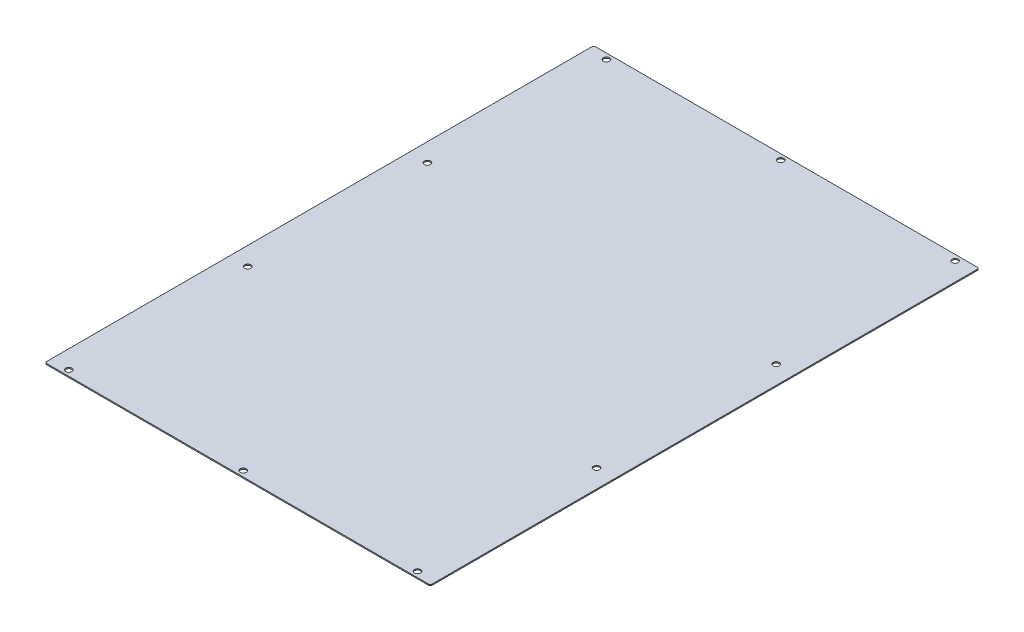
ISO-10303-21;
HEADER;
FILE_DESCRIPTION(('STEP AP214'),'2;1');
FILE_NAME('part.step','',(''),(''),'','','');
FILE_SCHEMA(('AUTOMOTIVE_DESIGN { 1 0 10303 214 1 1 1 1 }'));
ENDSEC;
DATA;
#1=APPLICATION_CONTEXT('core data for automotive mechanical design processes');
#2=APPLICATION_PROTOCOL_DEFINITION('international standard','automotive_design',2000,#1);
#3=PRODUCT_CONTEXT('',#1,'mechanical');
#4=PRODUCT('Part','Part','',(#3));
#5=PRODUCT_RELATED_PRODUCT_CATEGORY('part','',(#4));
#6=PRODUCT_DEFINITION_FORMATION('','',#4);
#7=PRODUCT_DEFINITION_CONTEXT('part definition',#1,'design');
#8=PRODUCT_DEFINITION('design','',#6,#7);
#9=PRODUCT_DEFINITION_SHAPE('','',#8);
#10=(LENGTH_UNIT() NAMED_UNIT(*) SI_UNIT(.MILLI.,.METRE.));
#11=(NAMED_UNIT(*) PLANE_ANGLE_UNIT() SI_UNIT($,.RADIAN.));
#12=(NAMED_UNIT(*) SI_UNIT($,.STERADIAN.) SOLID_ANGLE_UNIT());
#13=UNCERTAINTY_MEASURE_WITH_UNIT(LENGTH_MEASURE(1.E-05),#10,'distance_accuracy_value','');
#14=(GEOMETRIC_REPRESENTATION_CONTEXT(3) GLOBAL_UNCERTAINTY_ASSIGNED_CONTEXT((#13)) GLOBAL_UNIT_ASSIGNED_CONTEXT((#10,
#11,#12)) REPRESENTATION_CONTEXT('',''));
#15=CARTESIAN_POINT('',(0.,0.,0.));
#16=DIRECTION('',(0.,0.,1.));
#17=DIRECTION('',(1.,0.,0.));
#18=AXIS2_PLACEMENT_3D('',#15,#16,#17);
#19=CARTESIAN_POINT('',(0.,0.,0.));
#20=DIRECTION('',(0.,1.,0.));
#21=DIRECTION('',(0.,0.,1.));
#22=AXIS2_PLACEMENT_3D('',#19,#20,#21);
#23=PLANE('',#22);
#24=DIRECTION('',(0.,0.,-1.));
#25=VECTOR('',#24,1.);
#26=CARTESIAN_POINT('',(173.25,0.,-246.65));
#27=LINE('',#26,#25);
#28=CARTESIAN_POINT('',(173.25,0.,-245.65));
#29=VERTEX_POINT('',#28);
#30=CARTESIAN_POINT('',(173.25,0.,245.65));
#31=VERTEX_POINT('',#30);
#32=EDGE_CURVE('E424',#29,#31,#27,.F.);
#33=ORIENTED_EDGE('',*,*,#32,.F.);
#34=DIRECTION('',(0.707106781186567,0.,0.707106781186528));
#35=VECTOR('',#34,1.);
#36=CARTESIAN_POINT('',(173.25,0.,-245.65));
#37=LINE('',#36,#35);
#38=CARTESIAN_POINT('',(172.25,0.,-246.65));
#39=VERTEX_POINT('',#38);
#40=EDGE_CURVE('E427',#29,#39,#37,.F.);
#41=ORIENTED_EDGE('',*,*,#40,.T.);
#42=DIRECTION('',(-1.,0.,0.));
#43=VECTOR('',#42,1.);
#44=CARTESIAN_POINT('',(-173.25,0.,-246.65));
#45=LINE('',#44,#43);
#46=CARTESIAN_POINT('',(-172.25,0.,-246.65));
#47=VERTEX_POINT('',#46);
#48=EDGE_CURVE('E437',#47,#39,#45,.F.);
#49=ORIENTED_EDGE('',*,*,#48,.F.);
#50=DIRECTION('',(0.707106781186548,0.,-0.707106781186548));
#51=VECTOR('',#50,1.);
#52=CARTESIAN_POINT('',(-172.25,0.,-246.65));
#53=LINE('',#52,#51);
#54=CARTESIAN_POINT('',(-173.25,0.,-245.65));
#55=VERTEX_POINT('',#54);
#56=EDGE_CURVE('E452',#47,#55,#53,.F.);
#57=ORIENTED_EDGE('',*,*,#56,.T.);
#58=DIRECTION('',(0.,0.,1.));
#59=VECTOR('',#58,1.);
#60=CARTESIAN_POINT('',(-173.25,0.,-246.65));
#61=LINE('',#60,#59);
#62=CARTESIAN_POINT('',(-173.25,0.,245.65));
#63=VERTEX_POINT('',#62);
#64=EDGE_CURVE('E94',#63,#55,#61,.F.);
#65=ORIENTED_EDGE('',*,*,#64,.F.);
#66=DIRECTION('',(-0.707106781186567,0.,-0.707106781186528));
#67=VECTOR('',#66,1.);
#68=CARTESIAN_POINT('',(-173.25,0.,245.65));
#69=LINE('',#68,#67);
#70=CARTESIAN_POINT('',(-172.25,0.,246.65));
#71=VERTEX_POINT('',#70);
#72=EDGE_CURVE('E89',#63,#71,#69,.F.);
#73=ORIENTED_EDGE('',*,*,#72,.T.);
#74=DIRECTION('',(1.,0.,0.));
#75=VECTOR('',#74,1.);
#76=CARTESIAN_POINT('',(-173.25,0.,246.65));
#77=LINE('',#76,#75);
#78=CARTESIAN_POINT('',(172.25,0.,246.65));
#79=VERTEX_POINT('',#78);
#80=EDGE_CURVE('E79',#79,#71,#77,.F.);
#81=ORIENTED_EDGE('',*,*,#80,.F.);
#82=DIRECTION('',(-0.707106781186548,0.,0.707106781186548));
#83=VECTOR('',#82,1.);
#84=CARTESIAN_POINT('',(172.25,0.,246.65));
#85=LINE('',#84,#83);
#86=EDGE_CURVE('E104',#79,#31,#85,.F.);
#87=ORIENTED_EDGE('',*,*,#86,.T.);
#88=EDGE_LOOP('',(#33,#41,#49,#57,#65,#73,#81,#87));
#89=FACE_BOUND('',#88,.T.);
#90=CARTESIAN_POINT('',(-156.75,0.,-241.65));
#91=DIRECTION('',(0.,1.,0.));
#92=DIRECTION('',(0.,0.,1.));
#93=AXIS2_PLACEMENT_3D('',#90,#91,#92);
#94=CIRCLE('',#93,2.75);
#95=CARTESIAN_POINT('',(-156.75,0.,-238.9));
#96=VERTEX_POINT('',#95);
#97=EDGE_CURVE('E98',#96,#96,#94,.F.);
#98=ORIENTED_EDGE('',*,*,#97,.T.);
#99=EDGE_LOOP('',(#98));
#100=FACE_BOUND('',#99,.T.);
#101=CARTESIAN_POINT('',(-156.75,0.,241.65));
#102=DIRECTION('',(0.,1.,0.));
#103=DIRECTION('',(0.,0.,1.));
#104=AXIS2_PLACEMENT_3D('',#101,#102,#103);
#105=CIRCLE('',#104,2.75);
#106=CARTESIAN_POINT('',(-156.75,0.,244.4));
#107=VERTEX_POINT('',#106);
#108=EDGE_CURVE('E141',#107,#107,#105,.F.);
#109=ORIENTED_EDGE('',*,*,#108,.T.);
#110=EDGE_LOOP('',(#109));
#111=FACE_BOUND('',#110,.T.);
#112=CARTESIAN_POINT('',(156.75,0.,-80.75));
#113=DIRECTION('',(0.,1.,0.));
#114=DIRECTION('',(0.,0.,1.));
#115=AXIS2_PLACEMENT_3D('',#112,#113,#114);
#116=CIRCLE('',#115,2.75);
#117=CARTESIAN_POINT('',(156.75,0.,-78.));
#118=VERTEX_POINT('',#117);
#119=EDGE_CURVE('E144',#118,#118,#116,.F.);
#120=ORIENTED_EDGE('',*,*,#119,.T.);
#121=EDGE_LOOP('',(#120));
#122=FACE_BOUND('',#121,.T.);
#123=CARTESIAN_POINT('',(-156.75,0.,-80.75));
#124=DIRECTION('',(0.,1.,0.));
#125=DIRECTION('',(0.,0.,1.));
#126=AXIS2_PLACEMENT_3D('',#123,#124,#125);
#127=CIRCLE('',#126,2.75);
#128=CARTESIAN_POINT('',(-156.75,0.,-78.));
#129=VERTEX_POINT('',#128);
#130=EDGE_CURVE('E147',#129,#129,#127,.F.);
#131=ORIENTED_EDGE('',*,*,#130,.T.);
#132=EDGE_LOOP('',(#131));
#133=FACE_BOUND('',#132,.T.);
#134=CARTESIAN_POINT('',(156.75,0.,-241.65));
#135=DIRECTION('',(0.,1.,0.));
#136=DIRECTION('',(0.,0.,1.));
#137=AXIS2_PLACEMENT_3D('',#134,#135,#136);
#138=CIRCLE('',#137,2.75);
#139=CARTESIAN_POINT('',(156.75,0.,-238.9));
#140=VERTEX_POINT('',#139);
#141=EDGE_CURVE('E150',#140,#140,#138,.F.);
#142=ORIENTED_EDGE('',*,*,#141,.T.);
#143=EDGE_LOOP('',(#142));
#144=FACE_BOUND('',#143,.T.);
#145=CARTESIAN_POINT('',(-156.75,0.,80.75));
#146=DIRECTION('',(0.,1.,0.));
#147=DIRECTION('',(0.,0.,1.));
#148=AXIS2_PLACEMENT_3D('',#145,#146,#147);
#149=CIRCLE('',#148,2.75);
#150=CARTESIAN_POINT('',(-156.75,0.,83.5));
#151=VERTEX_POINT('',#150);
#152=EDGE_CURVE('E153',#151,#151,#149,.F.);
#153=ORIENTED_EDGE('',*,*,#152,.T.);
#154=EDGE_LOOP('',(#153));
#155=FACE_BOUND('',#154,.T.);
#156=CARTESIAN_POINT('',(156.75,0.,80.75));
#157=DIRECTION('',(0.,1.,0.));
#158=DIRECTION('',(0.,0.,1.));
#159=AXIS2_PLACEMENT_3D('',#156,#157,#158);
#160=CIRCLE('',#159,2.75);
#161=CARTESIAN_POINT('',(156.75,0.,83.5));
#162=VERTEX_POINT('',#161);
#163=EDGE_CURVE('E156',#162,#162,#160,.F.);
#164=ORIENTED_EDGE('',*,*,#163,.T.);
#165=EDGE_LOOP('',(#164));
#166=FACE_BOUND('',#165,.T.);
#167=CARTESIAN_POINT('',(0.,0.,241.65));
#168=DIRECTION('',(0.,1.,0.));
#169=DIRECTION('',(0.,0.,1.));
#170=AXIS2_PLACEMENT_3D('',#167,#168,#169);
#171=CIRCLE('',#170,2.75);
#172=CARTESIAN_POINT('',(0.,0.,244.4));
#173=VERTEX_POINT('',#172);
#174=EDGE_CURVE('E159',#173,#173,#171,.F.);
#175=ORIENTED_EDGE('',*,*,#174,.T.);
#176=EDGE_LOOP('',(#175));
#177=FACE_BOUND('',#176,.T.);
#178=CARTESIAN_POINT('',(0.,0.,-241.65));
#179=DIRECTION('',(0.,1.,0.));
#180=DIRECTION('',(0.,0.,1.));
#181=AXIS2_PLACEMENT_3D('',#178,#179,#180);
#182=CIRCLE('',#181,2.75);
#183=CARTESIAN_POINT('',(0.,0.,-238.9));
#184=VERTEX_POINT('',#183);
#185=EDGE_CURVE('E161',#184,#184,#182,.F.);
#186=ORIENTED_EDGE('',*,*,#185,.T.);
#187=EDGE_LOOP('',(#186));
#188=FACE_BOUND('',#187,.T.);
#189=CARTESIAN_POINT('',(156.75,0.,241.65));
#190=DIRECTION('',(0.,1.,0.));
#191=DIRECTION('',(0.,0.,1.));
#192=AXIS2_PLACEMENT_3D('',#189,#190,#191);
#193=CIRCLE('',#192,2.75);
#194=CARTESIAN_POINT('',(156.75,0.,244.4));
#195=VERTEX_POINT('',#194);
#196=EDGE_CURVE('E20',#195,#195,#193,.F.);
#197=ORIENTED_EDGE('',*,*,#196,.T.);
#198=EDGE_LOOP('',(#197));
#199=FACE_BOUND('',#198,.T.);
#200=ADVANCED_FACE('F17',(#89,#100,#111,#122,#133,#144,#155,#166,#177,#188,#199),#23,.T.);
#201=CARTESIAN_POINT('',(156.75,-1.,241.65));
#202=DIRECTION('',(0.,1.,0.));
#203=DIRECTION('',(0.,0.,1.));
#204=AXIS2_PLACEMENT_3D('',#201,#202,#203);
#205=CYLINDRICAL_SURFACE('',#204,2.75);
#206=CARTESIAN_POINT('',(156.75,-1.,241.65));
#207=DIRECTION('',(0.,1.,0.));
#208=DIRECTION('',(0.,0.,1.));
#209=AXIS2_PLACEMENT_3D('',#206,#207,#208);
#210=CIRCLE('',#209,2.75);
#211=CARTESIAN_POINT('',(156.75,-1.,244.4));
#212=VERTEX_POINT('',#211);
#213=EDGE_CURVE('E135',#212,#212,#210,.F.);
#214=ORIENTED_EDGE('',*,*,#213,.T.);
#215=EDGE_LOOP('',(#214));
#216=FACE_BOUND('',#215,.T.);
#217=ORIENTED_EDGE('',*,*,#196,.F.);
#218=EDGE_LOOP('',(#217));
#219=FACE_BOUND('',#218,.T.);
#220=ADVANCED_FACE('F169',(#216,#219),#205,.F.);
#221=CARTESIAN_POINT('',(0.,-1.,-241.65));
#222=DIRECTION('',(0.,1.,0.));
#223=DIRECTION('',(0.,0.,1.));
#224=AXIS2_PLACEMENT_3D('',#221,#222,#223);
#225=CYLINDRICAL_SURFACE('',#224,2.75);
#226=CARTESIAN_POINT('',(0.,-1.,-241.65));
#227=DIRECTION('',(0.,1.,0.));
#228=DIRECTION('',(0.,0.,1.));
#229=AXIS2_PLACEMENT_3D('',#226,#227,#228);
#230=CIRCLE('',#229,2.75);
#231=CARTESIAN_POINT('',(0.,-1.,-238.9));
#232=VERTEX_POINT('',#231);
#233=EDGE_CURVE('E132',#232,#232,#230,.F.);
#234=ORIENTED_EDGE('',*,*,#233,.T.);
#235=EDGE_LOOP('',(#234));
#236=FACE_BOUND('',#235,.T.);
#237=ORIENTED_EDGE('',*,*,#185,.F.);
#238=EDGE_LOOP('',(#237));
#239=FACE_BOUND('',#238,.T.);
#240=ADVANCED_FACE('F171',(#236,#239),#225,.F.);
#241=CARTESIAN_POINT('',(0.,-1.,241.65));
#242=DIRECTION('',(0.,1.,0.));
#243=DIRECTION('',(0.,0.,1.));
#244=AXIS2_PLACEMENT_3D('',#241,#242,#243);
#245=CYLINDRICAL_SURFACE('',#244,2.75);
#246=CARTESIAN_POINT('',(0.,-1.,241.65));
#247=DIRECTION('',(0.,1.,0.));
#248=DIRECTION('',(0.,0.,1.));
#249=AXIS2_PLACEMENT_3D('',#246,#247,#248);
#250=CIRCLE('',#249,2.75);
#251=CARTESIAN_POINT('',(0.,-1.,244.4));
#252=VERTEX_POINT('',#251);
#253=EDGE_CURVE('E129',#252,#252,#250,.F.);
#254=ORIENTED_EDGE('',*,*,#253,.T.);
#255=EDGE_LOOP('',(#254));
#256=FACE_BOUND('',#255,.T.);
#257=ORIENTED_EDGE('',*,*,#174,.F.);
#258=EDGE_LOOP('',(#257));
#259=FACE_BOUND('',#258,.T.);
#260=ADVANCED_FACE('F178',(#256,#259),#245,.F.);
#261=CARTESIAN_POINT('',(156.75,-1.,80.75));
#262=DIRECTION('',(0.,1.,0.));
#263=DIRECTION('',(0.,0.,1.));
#264=AXIS2_PLACEMENT_3D('',#261,#262,#263);
#265=CYLINDRICAL_SURFACE('',#264,2.75);
#266=CARTESIAN_POINT('',(156.75,-1.,80.75));
#267=DIRECTION('',(0.,1.,0.));
#268=DIRECTION('',(0.,0.,1.));
#269=AXIS2_PLACEMENT_3D('',#266,#267,#268);
#270=CIRCLE('',#269,2.75);
#271=CARTESIAN_POINT('',(156.75,-1.,83.5));
#272=VERTEX_POINT('',#271);
#273=EDGE_CURVE('E126',#272,#272,#270,.F.);
#274=ORIENTED_EDGE('',*,*,#273,.T.);
#275=EDGE_LOOP('',(#274));
#276=FACE_BOUND('',#275,.T.);
#277=ORIENTED_EDGE('',*,*,#163,.F.);
#278=EDGE_LOOP('',(#277));
#279=FACE_BOUND('',#278,.T.);
#280=ADVANCED_FACE('F240',(#276,#279),#265,.F.);
#281=CARTESIAN_POINT('',(-156.75,-1.,80.75));
#282=DIRECTION('',(0.,1.,0.));
#283=DIRECTION('',(0.,0.,1.));
#284=AXIS2_PLACEMENT_3D('',#281,#282,#283);
#285=CYLINDRICAL_SURFACE('',#284,2.75);
#286=CARTESIAN_POINT('',(-156.75,-1.,80.75));
#287=DIRECTION('',(0.,1.,0.));
#288=DIRECTION('',(0.,0.,1.));
#289=AXIS2_PLACEMENT_3D('',#286,#287,#288);
#290=CIRCLE('',#289,2.75);
#291=CARTESIAN_POINT('',(-156.75,-1.,83.5));
#292=VERTEX_POINT('',#291);
#293=EDGE_CURVE('E123',#292,#292,#290,.F.);
#294=ORIENTED_EDGE('',*,*,#293,.T.);
#295=EDGE_LOOP('',(#294));
#296=FACE_BOUND('',#295,.T.);
#297=ORIENTED_EDGE('',*,*,#152,.F.);
#298=EDGE_LOOP('',(#297));
#299=FACE_BOUND('',#298,.T.);
#300=ADVANCED_FACE('F236',(#296,#299),#285,.F.);
#301=CARTESIAN_POINT('',(156.75,-1.,-241.65));
#302=DIRECTION('',(0.,1.,0.));
#303=DIRECTION('',(0.,0.,1.));
#304=AXIS2_PLACEMENT_3D('',#301,#302,#303);
#305=CYLINDRICAL_SURFACE('',#304,2.75);
#306=CARTESIAN_POINT('',(156.75,-1.,-241.65));
#307=DIRECTION('',(0.,1.,0.));
#308=DIRECTION('',(0.,0.,1.));
#309=AXIS2_PLACEMENT_3D('',#306,#307,#308);
#310=CIRCLE('',#309,2.75);
#311=CARTESIAN_POINT('',(156.75,-1.,-238.9));
#312=VERTEX_POINT('',#311);
#313=EDGE_CURVE('E120',#312,#312,#310,.F.);
#314=ORIENTED_EDGE('',*,*,#313,.T.);
#315=EDGE_LOOP('',(#314));
#316=FACE_BOUND('',#315,.T.);
#317=ORIENTED_EDGE('',*,*,#141,.F.);
#318=EDGE_LOOP('',(#317));
#319=FACE_BOUND('',#318,.T.);
#320=ADVANCED_FACE('F232',(#316,#319),#305,.F.);
#321=CARTESIAN_POINT('',(-156.75,-1.,-80.75));
#322=DIRECTION('',(0.,1.,0.));
#323=DIRECTION('',(0.,0.,1.));
#324=AXIS2_PLACEMENT_3D('',#321,#322,#323);
#325=CYLINDRICAL_SURFACE('',#324,2.75);
#326=CARTESIAN_POINT('',(-156.75,-1.,-80.75));
#327=DIRECTION('',(0.,1.,0.));
#328=DIRECTION('',(0.,0.,1.));
#329=AXIS2_PLACEMENT_3D('',#326,#327,#328);
#330=CIRCLE('',#329,2.75);
#331=CARTESIAN_POINT('',(-156.75,-1.,-78.));
#332=VERTEX_POINT('',#331);
#333=EDGE_CURVE('E117',#332,#332,#330,.F.);
#334=ORIENTED_EDGE('',*,*,#333,.T.);
#335=EDGE_LOOP('',(#334));
#336=FACE_BOUND('',#335,.T.);
#337=ORIENTED_EDGE('',*,*,#130,.F.);
#338=EDGE_LOOP('',(#337));
#339=FACE_BOUND('',#338,.T.);
#340=ADVANCED_FACE('F228',(#336,#339),#325,.F.);
#341=CARTESIAN_POINT('',(156.75,-1.,-80.75));
#342=DIRECTION('',(0.,1.,0.));
#343=DIRECTION('',(0.,0.,1.));
#344=AXIS2_PLACEMENT_3D('',#341,#342,#343);
#345=CYLINDRICAL_SURFACE('',#344,2.75);
#346=CARTESIAN_POINT('',(156.75,-1.,-80.75));
#347=DIRECTION('',(0.,1.,0.));
#348=DIRECTION('',(0.,0.,1.));
#349=AXIS2_PLACEMENT_3D('',#346,#347,#348);
#350=CIRCLE('',#349,2.75);
#351=CARTESIAN_POINT('',(156.75,-1.,-78.));
#352=VERTEX_POINT('',#351);
#353=EDGE_CURVE('E114',#352,#352,#350,.F.);
#354=ORIENTED_EDGE('',*,*,#353,.T.);
#355=EDGE_LOOP('',(#354));
#356=FACE_BOUND('',#355,.T.);
#357=ORIENTED_EDGE('',*,*,#119,.F.);
#358=EDGE_LOOP('',(#357));
#359=FACE_BOUND('',#358,.T.);
#360=ADVANCED_FACE('F224',(#356,#359),#345,.F.);
#361=CARTESIAN_POINT('',(-156.75,-1.,241.65));
#362=DIRECTION('',(0.,1.,0.));
#363=DIRECTION('',(0.,0.,1.));
#364=AXIS2_PLACEMENT_3D('',#361,#362,#363);
#365=CYLINDRICAL_SURFACE('',#364,2.75);
#366=CARTESIAN_POINT('',(-156.75,-1.,241.65));
#367=DIRECTION('',(0.,1.,0.));
#368=DIRECTION('',(0.,0.,1.));
#369=AXIS2_PLACEMENT_3D('',#366,#367,#368);
#370=CIRCLE('',#369,2.75);
#371=CARTESIAN_POINT('',(-156.75,-1.,244.4));
#372=VERTEX_POINT('',#371);
#373=EDGE_CURVE('E111',#372,#372,#370,.F.);
#374=ORIENTED_EDGE('',*,*,#373,.T.);
#375=EDGE_LOOP('',(#374));
#376=FACE_BOUND('',#375,.T.);
#377=ORIENTED_EDGE('',*,*,#108,.F.);
#378=EDGE_LOOP('',(#377));
#379=FACE_BOUND('',#378,.T.);
#380=ADVANCED_FACE('F220',(#376,#379),#365,.F.);
#381=CARTESIAN_POINT('',(-156.75,-1.,-241.65));
#382=DIRECTION('',(0.,1.,0.));
#383=DIRECTION('',(0.,0.,1.));
#384=AXIS2_PLACEMENT_3D('',#381,#382,#383);
#385=CYLINDRICAL_SURFACE('',#384,2.75);
#386=CARTESIAN_POINT('',(-156.75,-1.,-241.65));
#387=DIRECTION('',(0.,1.,0.));
#388=DIRECTION('',(0.,0.,1.));
#389=AXIS2_PLACEMENT_3D('',#386,#387,#388);
#390=CIRCLE('',#389,2.75);
#391=CARTESIAN_POINT('',(-156.75,-1.,-238.9));
#392=VERTEX_POINT('',#391);
#393=EDGE_CURVE('E108',#392,#392,#390,.F.);
#394=ORIENTED_EDGE('',*,*,#393,.T.);
#395=EDGE_LOOP('',(#394));
#396=FACE_BOUND('',#395,.T.);
#397=ORIENTED_EDGE('',*,*,#97,.F.);
#398=EDGE_LOOP('',(#397));
#399=FACE_BOUND('',#398,.T.);
#400=ADVANCED_FACE('F217',(#396,#399),#385,.F.);
#401=CARTESIAN_POINT('',(-173.25,-1.,245.65));
#402=DIRECTION('',(0.707106781186528,0.,-0.707106781186567));
#403=DIRECTION('',(-0.707106781186567,0.,-0.707106781186528));
#404=AXIS2_PLACEMENT_3D('',#401,#402,#403);
#405=PLANE('',#404);
#406=DIRECTION('',(0.,1.,0.));
#407=VECTOR('',#406,1.);
#408=CARTESIAN_POINT('',(-172.25,-1.,246.65));
#409=LINE('',#408,#407);
#410=CARTESIAN_POINT('',(-172.25,-1.,246.65));
#411=VERTEX_POINT('',#410);
#412=EDGE_CURVE('E86',#71,#411,#409,.F.);
#413=ORIENTED_EDGE('',*,*,#412,.F.);
#414=ORIENTED_EDGE('',*,*,#72,.F.);
#415=DIRECTION('',(0.,1.,0.));
#416=VECTOR('',#415,1.);
#417=CARTESIAN_POINT('',(-173.25,-1.,245.65));
#418=LINE('',#417,#416);
#419=CARTESIAN_POINT('',(-173.25,-1.,245.65));
#420=VERTEX_POINT('',#419);
#421=EDGE_CURVE('E138',#420,#63,#418,.T.);
#422=ORIENTED_EDGE('',*,*,#421,.F.);
#423=DIRECTION('',(0.707106781186567,0.,0.707106781186528));
#424=VECTOR('',#423,1.);
#425=CARTESIAN_POINT('',(-173.25,-1.,245.65));
#426=LINE('',#425,#424);
#427=EDGE_CURVE('E102',#420,#411,#426,.T.);
#428=ORIENTED_EDGE('',*,*,#427,.T.);
#429=EDGE_LOOP('',(#413,#414,#422,#428));
#430=FACE_BOUND('',#429,.T.);
#431=ADVANCED_FACE('F101',(#430),#405,.F.);
#432=CARTESIAN_POINT('',(-173.25,-1.,246.65));
#433=DIRECTION('',(0.,0.,1.));
#434=DIRECTION('',(1.,0.,0.));
#435=AXIS2_PLACEMENT_3D('',#432,#433,#434);
#436=PLANE('',#435);
#437=ORIENTED_EDGE('',*,*,#80,.T.);
#438=ORIENTED_EDGE('',*,*,#412,.T.);
#439=DIRECTION('',(1.,0.,0.));
#440=VECTOR('',#439,1.);
#441=CARTESIAN_POINT('',(0.,-1.,246.65));
#442=LINE('',#441,#440);
#443=CARTESIAN_POINT('',(172.25,-1.,246.65));
#444=VERTEX_POINT('',#443);
#445=EDGE_CURVE('E443',#411,#444,#442,.T.);
#446=ORIENTED_EDGE('',*,*,#445,.T.);
#447=DIRECTION('',(0.,1.,0.));
#448=VECTOR('',#447,1.);
#449=CARTESIAN_POINT('',(172.25,-1.,246.65));
#450=LINE('',#449,#448);
#451=EDGE_CURVE('E88',#444,#79,#450,.T.);
#452=ORIENTED_EDGE('',*,*,#451,.T.);
#453=EDGE_LOOP('',(#437,#438,#446,#452));
#454=FACE_BOUND('',#453,.T.);
#455=ADVANCED_FACE('F83',(#454),#436,.T.);
#456=CARTESIAN_POINT('',(172.25,-1.,246.65));
#457=DIRECTION('',(-0.707106781186548,0.,-0.707106781186548));
#458=DIRECTION('',(-0.707106781186548,0.,0.707106781186548));
#459=AXIS2_PLACEMENT_3D('',#456,#457,#458);
#460=PLANE('',#459);
#461=DIRECTION('',(0.,1.,0.));
#462=VECTOR('',#461,1.);
#463=CARTESIAN_POINT('',(173.25,-1.,245.65));
#464=LINE('',#463,#462);
#465=CARTESIAN_POINT('',(173.25,-1.,245.65));
#466=VERTEX_POINT('',#465);
#467=EDGE_CURVE('E418',#31,#466,#464,.F.);
#468=ORIENTED_EDGE('',*,*,#467,.F.);
#469=ORIENTED_EDGE('',*,*,#86,.F.);
#470=ORIENTED_EDGE('',*,*,#451,.F.);
#471=DIRECTION('',(0.707106781186557,0.,-0.707106781186538));
#472=VECTOR('',#471,1.);
#473=CARTESIAN_POINT('',(172.25,-1.,246.65));
#474=LINE('',#473,#472);
#475=EDGE_CURVE('E420',#444,#466,#474,.T.);
#476=ORIENTED_EDGE('',*,*,#475,.T.);
#477=EDGE_LOOP('',(#468,#469,#470,#476));
#478=FACE_BOUND('',#477,.T.);
#479=ADVANCED_FACE('F208',(#478),#460,.F.);
#480=CARTESIAN_POINT('',(173.25,-1.,-246.65));
#481=DIRECTION('',(1.,0.,0.));
#482=DIRECTION('',(0.,0.,-1.));
#483=AXIS2_PLACEMENT_3D('',#480,#481,#482);
#484=PLANE('',#483);
#485=ORIENTED_EDGE('',*,*,#32,.T.);
#486=ORIENTED_EDGE('',*,*,#467,.T.);
#487=DIRECTION('',(0.,0.,1.));
#488=VECTOR('',#487,1.);
#489=CARTESIAN_POINT('',(173.25,-1.,0.));
#490=LINE('',#489,#488);
#491=CARTESIAN_POINT('',(173.25,-1.,-245.65));
#492=VERTEX_POINT('',#491);
#493=EDGE_CURVE('E438',#466,#492,#490,.F.);
#494=ORIENTED_EDGE('',*,*,#493,.T.);
#495=DIRECTION('',(0.,1.,0.));
#496=VECTOR('',#495,1.);
#497=CARTESIAN_POINT('',(173.25,-1.,-245.65));
#498=LINE('',#497,#496);
#499=EDGE_CURVE('E423',#492,#29,#498,.T.);
#500=ORIENTED_EDGE('',*,*,#499,.T.);
#501=EDGE_LOOP('',(#485,#486,#494,#500));
#502=FACE_BOUND('',#501,.T.);
#503=ADVANCED_FACE('F204',(#502),#484,.T.);
#504=CARTESIAN_POINT('',(173.25,-1.,-245.65));
#505=DIRECTION('',(-0.707106781186528,0.,0.707106781186567));
#506=DIRECTION('',(0.707106781186567,0.,0.707106781186528));
#507=AXIS2_PLACEMENT_3D('',#504,#505,#506);
#508=PLANE('',#507);
#509=DIRECTION('',(0.,1.,0.));
#510=VECTOR('',#509,1.);
#511=CARTESIAN_POINT('',(172.25,-1.,-246.65));
#512=LINE('',#511,#510);
#513=CARTESIAN_POINT('',(172.25,-1.,-246.65));
#514=VERTEX_POINT('',#513);
#515=EDGE_CURVE('E436',#39,#514,#512,.F.);
#516=ORIENTED_EDGE('',*,*,#515,.F.);
#517=ORIENTED_EDGE('',*,*,#40,.F.);
#518=ORIENTED_EDGE('',*,*,#499,.F.);
#519=DIRECTION('',(-0.707106781186567,0.,-0.707106781186528));
#520=VECTOR('',#519,1.);
#521=CARTESIAN_POINT('',(173.25,-1.,-245.65));
#522=LINE('',#521,#520);
#523=EDGE_CURVE('E439',#492,#514,#522,.T.);
#524=ORIENTED_EDGE('',*,*,#523,.T.);
#525=EDGE_LOOP('',(#516,#517,#518,#524));
#526=FACE_BOUND('',#525,.T.);
#527=ADVANCED_FACE('F200',(#526),#508,.F.);
#528=CARTESIAN_POINT('',(-173.25,-1.,-246.65));
#529=DIRECTION('',(0.,0.,-1.));
#530=DIRECTION('',(-1.,0.,0.));
#531=AXIS2_PLACEMENT_3D('',#528,#529,#530);
#532=PLANE('',#531);
#533=ORIENTED_EDGE('',*,*,#48,.T.);
#534=ORIENTED_EDGE('',*,*,#515,.T.);
#535=DIRECTION('',(1.,0.,0.));
#536=VECTOR('',#535,1.);
#537=CARTESIAN_POINT('',(0.,-1.,-246.65));
#538=LINE('',#537,#536);
#539=CARTESIAN_POINT('',(-172.25,-1.,-246.65));
#540=VERTEX_POINT('',#539);
#541=EDGE_CURVE('E441',#514,#540,#538,.F.);
#542=ORIENTED_EDGE('',*,*,#541,.T.);
#543=DIRECTION('',(0.,1.,0.));
#544=VECTOR('',#543,1.);
#545=CARTESIAN_POINT('',(-172.25,-1.,-246.65));
#546=LINE('',#545,#544);
#547=EDGE_CURVE('E454',#540,#47,#546,.T.);
#548=ORIENTED_EDGE('',*,*,#547,.T.);
#549=EDGE_LOOP('',(#533,#534,#542,#548));
#550=FACE_BOUND('',#549,.T.);
#551=ADVANCED_FACE('F196',(#550),#532,.T.);
#552=CARTESIAN_POINT('',(-172.25,-1.,-246.65));
#553=DIRECTION('',(0.707106781186548,0.,0.707106781186548));
#554=DIRECTION('',(0.707106781186548,0.,-0.707106781186548));
#555=AXIS2_PLACEMENT_3D('',#552,#553,#554);
#556=PLANE('',#555);
#557=DIRECTION('',(0.,1.,0.));
#558=VECTOR('',#557,1.);
#559=CARTESIAN_POINT('',(-173.25,-1.,-245.65));
#560=LINE('',#559,#558);
#561=CARTESIAN_POINT('',(-173.25,-1.,-245.65));
#562=VERTEX_POINT('',#561);
#563=EDGE_CURVE('E34',#55,#562,#560,.F.);
#564=ORIENTED_EDGE('',*,*,#563,.F.);
#565=ORIENTED_EDGE('',*,*,#56,.F.);
#566=ORIENTED_EDGE('',*,*,#547,.F.);
#567=DIRECTION('',(-0.707106781186557,0.,0.707106781186538));
#568=VECTOR('',#567,1.);
#569=CARTESIAN_POINT('',(-172.25,-1.,-246.65));
#570=LINE('',#569,#568);
#571=EDGE_CURVE('E26',#540,#562,#570,.T.);
#572=ORIENTED_EDGE('',*,*,#571,.T.);
#573=EDGE_LOOP('',(#564,#565,#566,#572));
#574=FACE_BOUND('',#573,.T.);
#575=ADVANCED_FACE('F189',(#574),#556,.F.);
#576=CARTESIAN_POINT('',(-173.25,-1.,-246.65));
#577=DIRECTION('',(-1.,0.,0.));
#578=DIRECTION('',(0.,0.,1.));
#579=AXIS2_PLACEMENT_3D('',#576,#577,#578);
#580=PLANE('',#579);
#581=DIRECTION('',(0.,0.,1.));
#582=VECTOR('',#581,1.);
#583=CARTESIAN_POINT('',(-173.25,-1.,0.));
#584=LINE('',#583,#582);
#585=EDGE_CURVE('E10',#562,#420,#584,.T.);
#586=ORIENTED_EDGE('',*,*,#585,.T.);
#587=ORIENTED_EDGE('',*,*,#421,.T.);
#588=ORIENTED_EDGE('',*,*,#64,.T.);
#589=ORIENTED_EDGE('',*,*,#563,.T.);
#590=EDGE_LOOP('',(#586,#587,#588,#589));
#591=FACE_BOUND('',#590,.T.);
#592=ADVANCED_FACE('F183',(#591),#580,.T.);
#593=CARTESIAN_POINT('',(0.,-1.,0.));
#594=DIRECTION('',(0.,1.,0.));
#595=DIRECTION('',(0.,0.,1.));
#596=AXIS2_PLACEMENT_3D('',#593,#594,#595);
#597=PLANE('',#596);
#598=ORIENTED_EDGE('',*,*,#571,.F.);
#599=ORIENTED_EDGE('',*,*,#541,.F.);
#600=ORIENTED_EDGE('',*,*,#523,.F.);
#601=ORIENTED_EDGE('',*,*,#493,.F.);
#602=ORIENTED_EDGE('',*,*,#475,.F.);
#603=ORIENTED_EDGE('',*,*,#445,.F.);
#604=ORIENTED_EDGE('',*,*,#427,.F.);
#605=ORIENTED_EDGE('',*,*,#585,.F.);
#606=EDGE_LOOP('',(#598,#599,#600,#601,#602,#603,#604,#605));
#607=FACE_BOUND('',#606,.T.);
#608=ORIENTED_EDGE('',*,*,#393,.F.);
#609=EDGE_LOOP('',(#608));
#610=FACE_BOUND('',#609,.T.);
#611=ORIENTED_EDGE('',*,*,#373,.F.);
#612=EDGE_LOOP('',(#611));
#613=FACE_BOUND('',#612,.T.);
#614=ORIENTED_EDGE('',*,*,#353,.F.);
#615=EDGE_LOOP('',(#614));
#616=FACE_BOUND('',#615,.T.);
#617=ORIENTED_EDGE('',*,*,#333,.F.);
#618=EDGE_LOOP('',(#617));
#619=FACE_BOUND('',#618,.T.);
#620=ORIENTED_EDGE('',*,*,#313,.F.);
#621=EDGE_LOOP('',(#620));
#622=FACE_BOUND('',#621,.T.);
#623=ORIENTED_EDGE('',*,*,#293,.F.);
#624=EDGE_LOOP('',(#623));
#625=FACE_BOUND('',#624,.T.);
#626=ORIENTED_EDGE('',*,*,#273,.F.);
#627=EDGE_LOOP('',(#626));
#628=FACE_BOUND('',#627,.T.);
#629=ORIENTED_EDGE('',*,*,#253,.F.);
#630=EDGE_LOOP('',(#629));
#631=FACE_BOUND('',#630,.T.);
#632=ORIENTED_EDGE('',*,*,#233,.F.);
#633=EDGE_LOOP('',(#632));
#634=FACE_BOUND('',#633,.T.);
#635=ORIENTED_EDGE('',*,*,#213,.F.);
#636=EDGE_LOOP('',(#635));
#637=FACE_BOUND('',#636,.T.);
#638=ADVANCED_FACE('F181',(#607,#610,#613,#616,#619,#622,#625,#628,#631,#634,#637),#597,.F.);
#639=CLOSED_SHELL('',(#200,#220,#240,#260,#280,#300,#320,#340,#360,#380,#400,#431,#455,#479,
#503,#527,#551,#575,#592,#638));
#640=MANIFOLD_SOLID_BREP('B1',#639);
#641=ADVANCED_BREP_SHAPE_REPRESENTATION('',(#18,#640),#14);
#642=SHAPE_DEFINITION_REPRESENTATION(#9,#641);
ENDSEC;
END-ISO-10303-21;
